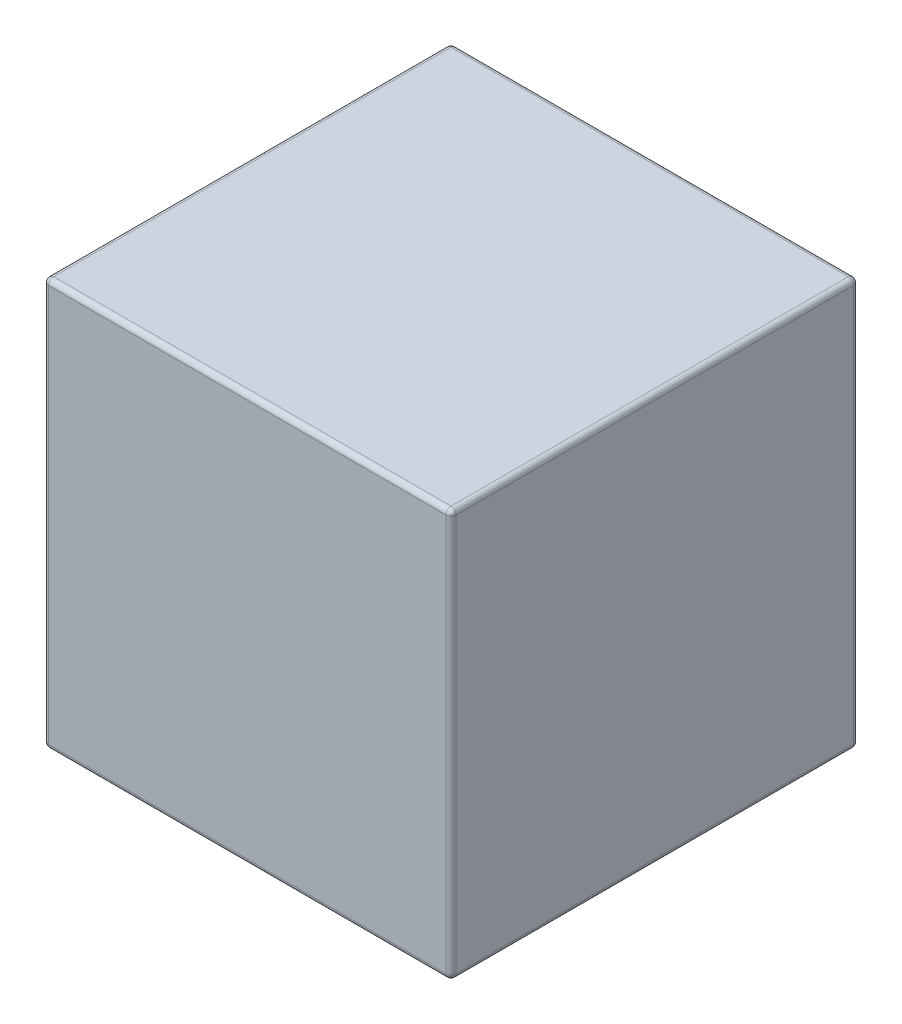
ISO-10303-21;
HEADER;
FILE_DESCRIPTION(('STEP AP214'),'2;1');
FILE_NAME('part.step','',(''),(''),'','','');
FILE_SCHEMA(('AUTOMOTIVE_DESIGN { 1 0 10303 214 1 1 1 1 }'));
ENDSEC;
DATA;
#1=APPLICATION_CONTEXT('core data for automotive mechanical design processes');
#2=APPLICATION_PROTOCOL_DEFINITION('international standard','automotive_design',2000,#1);
#3=PRODUCT_CONTEXT('',#1,'mechanical');
#4=PRODUCT('Part','Part','',(#3));
#5=PRODUCT_RELATED_PRODUCT_CATEGORY('part','',(#4));
#6=PRODUCT_DEFINITION_FORMATION('','',#4);
#7=PRODUCT_DEFINITION_CONTEXT('part definition',#1,'design');
#8=PRODUCT_DEFINITION('design','',#6,#7);
#9=PRODUCT_DEFINITION_SHAPE('','',#8);
#10=(LENGTH_UNIT() NAMED_UNIT(*) SI_UNIT(.MILLI.,.METRE.));
#11=(NAMED_UNIT(*) PLANE_ANGLE_UNIT() SI_UNIT($,.RADIAN.));
#12=(NAMED_UNIT(*) SI_UNIT($,.STERADIAN.) SOLID_ANGLE_UNIT());
#13=UNCERTAINTY_MEASURE_WITH_UNIT(LENGTH_MEASURE(1.E-05),#10,'distance_accuracy_value','');
#14=(GEOMETRIC_REPRESENTATION_CONTEXT(3) GLOBAL_UNCERTAINTY_ASSIGNED_CONTEXT((#13)) GLOBAL_UNIT_ASSIGNED_CONTEXT((#10,
#11,#12)) REPRESENTATION_CONTEXT('',''));
#15=CARTESIAN_POINT('',(0.,0.,0.));
#16=DIRECTION('',(0.,0.,1.));
#17=DIRECTION('',(1.,0.,0.));
#18=AXIS2_PLACEMENT_3D('',#15,#16,#17);
#19=CARTESIAN_POINT('',(25.4,50.8,25.4));
#20=DIRECTION('',(-1.,0.,0.));
#21=DIRECTION('',(0.,0.,1.));
#22=AXIS2_PLACEMENT_3D('',#19,#20,#21);
#23=PLANE('',#22);
#24=DIRECTION('',(0.,0.,-1.));
#25=VECTOR('',#24,1.);
#26=CARTESIAN_POINT('',(25.4,0.634999999999997,-25.4));
#27=LINE('',#26,#25);
#28=CARTESIAN_POINT('',(25.4,0.634999999999997,24.765));
#29=VERTEX_POINT('',#28);
#30=CARTESIAN_POINT('',(25.4,0.634999999999997,-24.765));
#31=VERTEX_POINT('',#30);
#32=EDGE_CURVE('E334',#29,#31,#27,.T.);
#33=ORIENTED_EDGE('',*,*,#32,.T.);
#34=DIRECTION('',(0.,-1.,0.));
#35=VECTOR('',#34,1.);
#36=CARTESIAN_POINT('',(25.4,50.8,-24.765));
#37=LINE('',#36,#35);
#38=CARTESIAN_POINT('',(25.4,50.165,-24.765));
#39=VERTEX_POINT('',#38);
#40=EDGE_CURVE('E254',#31,#39,#37,.F.);
#41=ORIENTED_EDGE('',*,*,#40,.T.);
#42=DIRECTION('',(0.,0.,-1.));
#43=VECTOR('',#42,1.);
#44=CARTESIAN_POINT('',(25.4,50.165,25.4));
#45=LINE('',#44,#43);
#46=CARTESIAN_POINT('',(25.4,50.165,24.765));
#47=VERTEX_POINT('',#46);
#48=EDGE_CURVE('E241',#39,#47,#45,.F.);
#49=ORIENTED_EDGE('',*,*,#48,.T.);
#50=DIRECTION('',(0.,-1.,0.));
#51=VECTOR('',#50,1.);
#52=CARTESIAN_POINT('',(25.4,50.8,24.765));
#53=LINE('',#52,#51);
#54=EDGE_CURVE('E329',#47,#29,#53,.T.);
#55=ORIENTED_EDGE('',*,*,#54,.T.);
#56=EDGE_LOOP('',(#33,#41,#49,#55));
#57=FACE_BOUND('',#56,.T.);
#58=ADVANCED_FACE('F43',(#57),#23,.F.);
#59=CARTESIAN_POINT('',(-25.4,50.8,-25.4));
#60=DIRECTION('',(0.,0.,1.));
#61=DIRECTION('',(1.,0.,0.));
#62=AXIS2_PLACEMENT_3D('',#59,#60,#61);
#63=PLANE('',#62);
#64=DIRECTION('',(-1.,0.,0.));
#65=VECTOR('',#64,1.);
#66=CARTESIAN_POINT('',(-25.4,0.634999999999997,-25.4));
#67=LINE('',#66,#65);
#68=CARTESIAN_POINT('',(24.765,0.634999999999997,-25.4));
#69=VERTEX_POINT('',#68);
#70=CARTESIAN_POINT('',(-24.765,0.634999999999997,-25.4));
#71=VERTEX_POINT('',#70);
#72=EDGE_CURVE('E307',#69,#71,#67,.T.);
#73=ORIENTED_EDGE('',*,*,#72,.T.);
#74=DIRECTION('',(0.,-1.,0.));
#75=VECTOR('',#74,1.);
#76=CARTESIAN_POINT('',(-24.765,50.8,-25.4));
#77=LINE('',#76,#75);
#78=CARTESIAN_POINT('',(-24.765,50.165,-25.4));
#79=VERTEX_POINT('',#78);
#80=EDGE_CURVE('E304',#71,#79,#77,.F.);
#81=ORIENTED_EDGE('',*,*,#80,.T.);
#82=DIRECTION('',(-1.,0.,0.));
#83=VECTOR('',#82,1.);
#84=CARTESIAN_POINT('',(-25.4,50.165,-25.4));
#85=LINE('',#84,#83);
#86=CARTESIAN_POINT('',(24.765,50.165,-25.4));
#87=VERTEX_POINT('',#86);
#88=EDGE_CURVE('E295',#79,#87,#85,.F.);
#89=ORIENTED_EDGE('',*,*,#88,.T.);
#90=DIRECTION('',(0.,-1.,0.));
#91=VECTOR('',#90,1.);
#92=CARTESIAN_POINT('',(24.765,50.8,-25.4));
#93=LINE('',#92,#91);
#94=EDGE_CURVE('E301',#87,#69,#93,.T.);
#95=ORIENTED_EDGE('',*,*,#94,.T.);
#96=EDGE_LOOP('',(#73,#81,#89,#95));
#97=FACE_BOUND('',#96,.T.);
#98=ADVANCED_FACE('F305',(#97),#63,.F.);
#99=CARTESIAN_POINT('',(-25.4,50.8,25.4));
#100=DIRECTION('',(1.,0.,0.));
#101=DIRECTION('',(0.,0.,-1.));
#102=AXIS2_PLACEMENT_3D('',#99,#100,#101);
#103=PLANE('',#102);
#104=DIRECTION('',(0.,0.,1.));
#105=VECTOR('',#104,1.);
#106=CARTESIAN_POINT('',(-25.4,50.165,25.4));
#107=LINE('',#106,#105);
#108=CARTESIAN_POINT('',(-25.4,50.165,24.765));
#109=VERTEX_POINT('',#108);
#110=CARTESIAN_POINT('',(-25.4,50.165,-24.765));
#111=VERTEX_POINT('',#110);
#112=EDGE_CURVE('E144',#109,#111,#107,.F.);
#113=ORIENTED_EDGE('',*,*,#112,.T.);
#114=DIRECTION('',(0.,-1.,0.));
#115=VECTOR('',#114,1.);
#116=CARTESIAN_POINT('',(-25.4,50.8,-24.765));
#117=LINE('',#116,#115);
#118=CARTESIAN_POINT('',(-25.4,0.634999999999997,-24.765));
#119=VERTEX_POINT('',#118);
#120=EDGE_CURVE('E139',#111,#119,#117,.T.);
#121=ORIENTED_EDGE('',*,*,#120,.T.);
#122=DIRECTION('',(0.,0.,1.));
#123=VECTOR('',#122,1.);
#124=CARTESIAN_POINT('',(-25.4,0.634999999999997,25.4));
#125=LINE('',#124,#123);
#126=CARTESIAN_POINT('',(-25.4,0.634999999999997,24.765));
#127=VERTEX_POINT('',#126);
#128=EDGE_CURVE('E133',#119,#127,#125,.T.);
#129=ORIENTED_EDGE('',*,*,#128,.T.);
#130=DIRECTION('',(0.,-1.,0.));
#131=VECTOR('',#130,1.);
#132=CARTESIAN_POINT('',(-25.4,50.8,24.765));
#133=LINE('',#132,#131);
#134=EDGE_CURVE('E136',#127,#109,#133,.F.);
#135=ORIENTED_EDGE('',*,*,#134,.T.);
#136=EDGE_LOOP('',(#113,#121,#129,#135));
#137=FACE_BOUND('',#136,.T.);
#138=ADVANCED_FACE('F135',(#137),#103,.F.);
#139=CARTESIAN_POINT('',(-25.4,50.8,25.4));
#140=DIRECTION('',(0.,0.,-1.));
#141=DIRECTION('',(-1.,0.,0.));
#142=AXIS2_PLACEMENT_3D('',#139,#140,#141);
#143=PLANE('',#142);
#144=DIRECTION('',(1.,0.,0.));
#145=VECTOR('',#144,1.);
#146=CARTESIAN_POINT('',(-25.4,50.165,25.4));
#147=LINE('',#146,#145);
#148=CARTESIAN_POINT('',(24.765,50.165,25.4));
#149=VERTEX_POINT('',#148);
#150=CARTESIAN_POINT('',(-24.765,50.165,25.4));
#151=VERTEX_POINT('',#150);
#152=EDGE_CURVE('E53',#149,#151,#147,.F.);
#153=ORIENTED_EDGE('',*,*,#152,.T.);
#154=DIRECTION('',(0.,-1.,0.));
#155=VECTOR('',#154,1.);
#156=CARTESIAN_POINT('',(-24.765,50.8,25.4));
#157=LINE('',#156,#155);
#158=CARTESIAN_POINT('',(-24.765,0.634999999999997,25.4));
#159=VERTEX_POINT('',#158);
#160=EDGE_CURVE('E11',#151,#159,#157,.T.);
#161=ORIENTED_EDGE('',*,*,#160,.T.);
#162=DIRECTION('',(1.,0.,0.));
#163=VECTOR('',#162,1.);
#164=CARTESIAN_POINT('',(25.4,0.634999999999997,25.4));
#165=LINE('',#164,#163);
#166=CARTESIAN_POINT('',(24.765,0.634999999999997,25.4));
#167=VERTEX_POINT('',#166);
#168=EDGE_CURVE('E261',#159,#167,#165,.T.);
#169=ORIENTED_EDGE('',*,*,#168,.T.);
#170=DIRECTION('',(0.,-1.,0.));
#171=VECTOR('',#170,1.);
#172=CARTESIAN_POINT('',(24.765,50.8,25.4));
#173=LINE('',#172,#171);
#174=EDGE_CURVE('E64',#167,#149,#173,.F.);
#175=ORIENTED_EDGE('',*,*,#174,.T.);
#176=EDGE_LOOP('',(#153,#161,#169,#175));
#177=FACE_BOUND('',#176,.T.);
#178=ADVANCED_FACE('F440',(#177),#143,.F.);
#179=CARTESIAN_POINT('',(0.,50.8,0.));
#180=DIRECTION('',(0.,-1.,0.));
#181=DIRECTION('',(0.,0.,-1.));
#182=AXIS2_PLACEMENT_3D('',#179,#180,#181);
#183=PLANE('',#182);
#184=DIRECTION('',(-1.,0.,0.));
#185=VECTOR('',#184,1.);
#186=CARTESIAN_POINT('',(0.,50.8,-24.765));
#187=LINE('',#186,#185);
#188=CARTESIAN_POINT('',(24.765,50.8,-24.765));
#189=VERTEX_POINT('',#188);
#190=CARTESIAN_POINT('',(-24.765,50.8,-24.765));
#191=VERTEX_POINT('',#190);
#192=EDGE_CURVE('E247',#189,#191,#187,.T.);
#193=ORIENTED_EDGE('',*,*,#192,.T.);
#194=DIRECTION('',(0.,0.,1.));
#195=VECTOR('',#194,1.);
#196=CARTESIAN_POINT('',(-24.765,50.8,0.));
#197=LINE('',#196,#195);
#198=CARTESIAN_POINT('',(-24.765,50.8,24.765));
#199=VERTEX_POINT('',#198);
#200=EDGE_CURVE('E252',#191,#199,#197,.T.);
#201=ORIENTED_EDGE('',*,*,#200,.T.);
#202=DIRECTION('',(1.,0.,0.));
#203=VECTOR('',#202,1.);
#204=CARTESIAN_POINT('',(0.,50.8,24.765));
#205=LINE('',#204,#203);
#206=CARTESIAN_POINT('',(24.765,50.8,24.765));
#207=VERTEX_POINT('',#206);
#208=EDGE_CURVE('E248',#199,#207,#205,.T.);
#209=ORIENTED_EDGE('',*,*,#208,.T.);
#210=DIRECTION('',(0.,0.,-1.));
#211=VECTOR('',#210,1.);
#212=CARTESIAN_POINT('',(24.765,50.8,0.));
#213=LINE('',#212,#211);
#214=EDGE_CURVE('E243',#207,#189,#213,.T.);
#215=ORIENTED_EDGE('',*,*,#214,.T.);
#216=EDGE_LOOP('',(#193,#201,#209,#215));
#217=FACE_BOUND('',#216,.T.);
#218=ADVANCED_FACE('F364',(#217),#183,.F.);
#219=CARTESIAN_POINT('',(0.,0.,0.));
#220=DIRECTION('',(0.,-1.,0.));
#221=DIRECTION('',(0.,0.,-1.));
#222=AXIS2_PLACEMENT_3D('',#219,#220,#221);
#223=PLANE('',#222);
#224=DIRECTION('',(0.,0.,1.));
#225=VECTOR('',#224,1.);
#226=CARTESIAN_POINT('',(-24.765,0.,-25.4));
#227=LINE('',#226,#225);
#228=CARTESIAN_POINT('',(-24.765,0.,24.765));
#229=VERTEX_POINT('',#228);
#230=CARTESIAN_POINT('',(-24.765,0.,-24.765));
#231=VERTEX_POINT('',#230);
#232=EDGE_CURVE('E167',#229,#231,#227,.F.);
#233=ORIENTED_EDGE('',*,*,#232,.T.);
#234=DIRECTION('',(-1.,0.,0.));
#235=VECTOR('',#234,1.);
#236=CARTESIAN_POINT('',(25.4,0.,-24.765));
#237=LINE('',#236,#235);
#238=CARTESIAN_POINT('',(24.765,0.,-24.765));
#239=VERTEX_POINT('',#238);
#240=EDGE_CURVE('E325',#231,#239,#237,.F.);
#241=ORIENTED_EDGE('',*,*,#240,.T.);
#242=DIRECTION('',(0.,0.,-1.));
#243=VECTOR('',#242,1.);
#244=CARTESIAN_POINT('',(24.765,0.,25.4));
#245=LINE('',#244,#243);
#246=CARTESIAN_POINT('',(24.765,0.,24.765));
#247=VERTEX_POINT('',#246);
#248=EDGE_CURVE('E316',#239,#247,#245,.F.);
#249=ORIENTED_EDGE('',*,*,#248,.T.);
#250=DIRECTION('',(1.,0.,0.));
#251=VECTOR('',#250,1.);
#252=CARTESIAN_POINT('',(-25.4,0.,24.765));
#253=LINE('',#252,#251);
#254=EDGE_CURVE('E312',#247,#229,#253,.F.);
#255=ORIENTED_EDGE('',*,*,#254,.T.);
#256=EDGE_LOOP('',(#233,#241,#249,#255));
#257=FACE_BOUND('',#256,.T.);
#258=ADVANCED_FACE('F431',(#257),#223,.T.);
#259=CARTESIAN_POINT('',(24.765,50.8,24.765));
#260=DIRECTION('',(0.,-1.,0.));
#261=DIRECTION('',(0.,0.,-1.));
#262=AXIS2_PLACEMENT_3D('',#259,#260,#261);
#263=CYLINDRICAL_SURFACE('',#262,0.635);
#264=CARTESIAN_POINT('',(24.765,50.165,24.765));
#265=DIRECTION('',(0.,1.,0.));
#266=DIRECTION('',(0.,0.,1.));
#267=AXIS2_PLACEMENT_3D('',#264,#265,#266);
#268=CIRCLE('',#267,0.635);
#269=EDGE_CURVE('E47',#149,#47,#268,.T.);
#270=ORIENTED_EDGE('',*,*,#269,.F.);
#271=ORIENTED_EDGE('',*,*,#174,.F.);
#272=CARTESIAN_POINT('',(24.765,0.634999999999997,24.765));
#273=DIRECTION('',(0.,-1.,0.));
#274=DIRECTION('',(0.,0.,-1.));
#275=AXIS2_PLACEMENT_3D('',#272,#273,#274);
#276=CIRCLE('',#275,0.635);
#277=EDGE_CURVE('E221',#29,#167,#276,.T.);
#278=ORIENTED_EDGE('',*,*,#277,.F.);
#279=ORIENTED_EDGE('',*,*,#54,.F.);
#280=EDGE_LOOP('',(#270,#271,#278,#279));
#281=FACE_BOUND('',#280,.T.);
#282=ADVANCED_FACE('F45',(#281),#263,.T.);
#283=CARTESIAN_POINT('',(24.765,50.165,24.765));
#284=DIRECTION('',(1.,0.,0.));
#285=DIRECTION('',(0.,0.,-1.));
#286=AXIS2_PLACEMENT_3D('',#283,#284,#285);
#287=SPHERICAL_SURFACE('',#286,0.635);
#288=CARTESIAN_POINT('',(24.765,50.165,24.765));
#289=DIRECTION('',(1.,0.,0.));
#290=DIRECTION('',(0.,0.,-1.));
#291=AXIS2_PLACEMENT_3D('',#288,#289,#290);
#292=CIRCLE('',#291,0.635);
#293=EDGE_CURVE('E214',#149,#207,#292,.F.);
#294=ORIENTED_EDGE('',*,*,#293,.F.);
#295=ORIENTED_EDGE('',*,*,#269,.T.);
#296=CARTESIAN_POINT('',(24.765,50.165,24.765));
#297=DIRECTION('',(0.,0.,1.));
#298=DIRECTION('',(1.,0.,0.));
#299=AXIS2_PLACEMENT_3D('',#296,#297,#298);
#300=CIRCLE('',#299,0.635);
#301=EDGE_CURVE('E218',#207,#47,#300,.F.);
#302=ORIENTED_EDGE('',*,*,#301,.F.);
#303=EDGE_LOOP('',(#294,#295,#302));
#304=FACE_BOUND('',#303,.T.);
#305=ADVANCED_FACE('F233',(#304),#287,.T.);
#306=CARTESIAN_POINT('',(24.765,0.635,24.765));
#307=DIRECTION('',(0.,0.,1.));
#308=DIRECTION('',(0.,-1.,0.));
#309=AXIS2_PLACEMENT_3D('',#306,#307,#308);
#310=SPHERICAL_SURFACE('',#309,0.635);
#311=CARTESIAN_POINT('',(24.765,0.635,24.765));
#312=DIRECTION('',(0.,0.,1.));
#313=DIRECTION('',(1.,0.,0.));
#314=AXIS2_PLACEMENT_3D('',#311,#312,#313);
#315=CIRCLE('',#314,0.635);
#316=EDGE_CURVE('E206',#29,#247,#315,.F.);
#317=ORIENTED_EDGE('',*,*,#316,.F.);
#318=ORIENTED_EDGE('',*,*,#277,.T.);
#319=CARTESIAN_POINT('',(24.765,0.634999999999997,24.765));
#320=DIRECTION('',(1.,0.,0.));
#321=DIRECTION('',(0.,0.,-1.));
#322=AXIS2_PLACEMENT_3D('',#319,#320,#321);
#323=CIRCLE('',#322,0.635);
#324=EDGE_CURVE('E210',#247,#167,#323,.F.);
#325=ORIENTED_EDGE('',*,*,#324,.F.);
#326=EDGE_LOOP('',(#317,#318,#325));
#327=FACE_BOUND('',#326,.T.);
#328=ADVANCED_FACE('F382',(#327),#310,.T.);
#329=CARTESIAN_POINT('',(24.765,50.165,0.));
#330=DIRECTION('',(0.,0.,-1.));
#331=DIRECTION('',(-1.,0.,0.));
#332=AXIS2_PLACEMENT_3D('',#329,#330,#331);
#333=CYLINDRICAL_SURFACE('',#332,0.635);
#334=ORIENTED_EDGE('',*,*,#301,.T.);
#335=ORIENTED_EDGE('',*,*,#48,.F.);
#336=CARTESIAN_POINT('',(24.765,50.165,-24.765));
#337=DIRECTION('',(0.,0.,-1.));
#338=DIRECTION('',(-1.,0.,0.));
#339=AXIS2_PLACEMENT_3D('',#336,#337,#338);
#340=CIRCLE('',#339,0.635);
#341=EDGE_CURVE('E199',#189,#39,#340,.T.);
#342=ORIENTED_EDGE('',*,*,#341,.F.);
#343=ORIENTED_EDGE('',*,*,#214,.F.);
#344=EDGE_LOOP('',(#334,#335,#342,#343));
#345=FACE_BOUND('',#344,.T.);
#346=ADVANCED_FACE('F239',(#345),#333,.T.);
#347=CARTESIAN_POINT('',(0.,50.165,24.765));
#348=DIRECTION('',(1.,0.,0.));
#349=DIRECTION('',(0.,0.,-1.));
#350=AXIS2_PLACEMENT_3D('',#347,#348,#349);
#351=CYLINDRICAL_SURFACE('',#350,0.635);
#352=ORIENTED_EDGE('',*,*,#293,.T.);
#353=ORIENTED_EDGE('',*,*,#208,.F.);
#354=CARTESIAN_POINT('',(-24.765,50.165,24.765));
#355=DIRECTION('',(-1.,0.,0.));
#356=DIRECTION('',(0.,0.,1.));
#357=AXIS2_PLACEMENT_3D('',#354,#355,#356);
#358=CIRCLE('',#357,0.635);
#359=EDGE_CURVE('E195',#151,#199,#358,.T.);
#360=ORIENTED_EDGE('',*,*,#359,.F.);
#361=ORIENTED_EDGE('',*,*,#152,.F.);
#362=EDGE_LOOP('',(#352,#353,#360,#361));
#363=FACE_BOUND('',#362,.T.);
#364=ADVANCED_FACE('F373',(#363),#351,.T.);
#365=CARTESIAN_POINT('',(-24.765,50.8,24.765));
#366=DIRECTION('',(0.,-1.,0.));
#367=DIRECTION('',(0.,0.,-1.));
#368=AXIS2_PLACEMENT_3D('',#365,#366,#367);
#369=CYLINDRICAL_SURFACE('',#368,0.635);
#370=CARTESIAN_POINT('',(-24.765,0.634999999999997,24.765));
#371=DIRECTION('',(0.,-1.,0.));
#372=DIRECTION('',(0.,0.,-1.));
#373=AXIS2_PLACEMENT_3D('',#370,#371,#372);
#374=CIRCLE('',#373,0.635);
#375=EDGE_CURVE('E150',#159,#127,#374,.T.);
#376=ORIENTED_EDGE('',*,*,#375,.F.);
#377=ORIENTED_EDGE('',*,*,#160,.F.);
#378=CARTESIAN_POINT('',(-24.765,50.165,24.765));
#379=DIRECTION('',(0.,1.,0.));
#380=DIRECTION('',(0.,0.,1.));
#381=AXIS2_PLACEMENT_3D('',#378,#379,#380);
#382=CIRCLE('',#381,0.635);
#383=EDGE_CURVE('E153',#109,#151,#382,.T.);
#384=ORIENTED_EDGE('',*,*,#383,.F.);
#385=ORIENTED_EDGE('',*,*,#134,.F.);
#386=EDGE_LOOP('',(#376,#377,#384,#385));
#387=FACE_BOUND('',#386,.T.);
#388=ADVANCED_FACE('F149',(#387),#369,.T.);
#389=CARTESIAN_POINT('',(-25.4,0.634999999999997,24.765));
#390=DIRECTION('',(-1.,0.,0.));
#391=DIRECTION('',(0.,0.,1.));
#392=AXIS2_PLACEMENT_3D('',#389,#390,#391);
#393=CYLINDRICAL_SURFACE('',#392,0.635);
#394=ORIENTED_EDGE('',*,*,#324,.T.);
#395=ORIENTED_EDGE('',*,*,#168,.F.);
#396=CARTESIAN_POINT('',(-24.765,0.635,24.765));
#397=DIRECTION('',(-1.,0.,0.));
#398=DIRECTION('',(0.,0.,1.));
#399=AXIS2_PLACEMENT_3D('',#396,#397,#398);
#400=CIRCLE('',#399,0.635);
#401=EDGE_CURVE('E163',#229,#159,#400,.T.);
#402=ORIENTED_EDGE('',*,*,#401,.F.);
#403=ORIENTED_EDGE('',*,*,#254,.F.);
#404=EDGE_LOOP('',(#394,#395,#402,#403));
#405=FACE_BOUND('',#404,.T.);
#406=ADVANCED_FACE('F380',(#405),#393,.T.);
#407=CARTESIAN_POINT('',(24.765,0.634999999999997,25.4));
#408=DIRECTION('',(0.,0.,1.));
#409=DIRECTION('',(1.,0.,0.));
#410=AXIS2_PLACEMENT_3D('',#407,#408,#409);
#411=CYLINDRICAL_SURFACE('',#410,0.635);
#412=ORIENTED_EDGE('',*,*,#316,.T.);
#413=ORIENTED_EDGE('',*,*,#248,.F.);
#414=CARTESIAN_POINT('',(24.765,0.634999999999997,-24.765));
#415=DIRECTION('',(0.,0.,-1.));
#416=DIRECTION('',(-1.,0.,0.));
#417=AXIS2_PLACEMENT_3D('',#414,#415,#416);
#418=CIRCLE('',#417,0.635);
#419=EDGE_CURVE('E187',#31,#239,#418,.T.);
#420=ORIENTED_EDGE('',*,*,#419,.F.);
#421=ORIENTED_EDGE('',*,*,#32,.F.);
#422=EDGE_LOOP('',(#412,#413,#420,#421));
#423=FACE_BOUND('',#422,.T.);
#424=ADVANCED_FACE('F348',(#423),#411,.T.);
#425=CARTESIAN_POINT('',(24.765,50.8,-24.765));
#426=DIRECTION('',(0.,-1.,0.));
#427=DIRECTION('',(0.,0.,-1.));
#428=AXIS2_PLACEMENT_3D('',#425,#426,#427);
#429=CYLINDRICAL_SURFACE('',#428,0.635);
#430=CARTESIAN_POINT('',(24.765,50.165,-24.765));
#431=DIRECTION('',(0.,1.,0.));
#432=DIRECTION('',(0.,0.,1.));
#433=AXIS2_PLACEMENT_3D('',#430,#431,#432);
#434=CIRCLE('',#433,0.635);
#435=EDGE_CURVE('E202',#39,#87,#434,.T.);
#436=ORIENTED_EDGE('',*,*,#435,.F.);
#437=ORIENTED_EDGE('',*,*,#40,.F.);
#438=CARTESIAN_POINT('',(24.765,0.634999999999997,-24.765));
#439=DIRECTION('',(0.,-1.,0.));
#440=DIRECTION('',(0.,0.,-1.));
#441=AXIS2_PLACEMENT_3D('',#438,#439,#440);
#442=CIRCLE('',#441,0.635);
#443=EDGE_CURVE('E183',#69,#31,#442,.T.);
#444=ORIENTED_EDGE('',*,*,#443,.F.);
#445=ORIENTED_EDGE('',*,*,#94,.F.);
#446=EDGE_LOOP('',(#436,#437,#444,#445));
#447=FACE_BOUND('',#446,.T.);
#448=ADVANCED_FACE('F344',(#447),#429,.T.);
#449=CARTESIAN_POINT('',(24.765,50.165,-24.765));
#450=DIRECTION('',(1.,0.,0.));
#451=DIRECTION('',(0.,0.,-1.));
#452=AXIS2_PLACEMENT_3D('',#449,#450,#451);
#453=SPHERICAL_SURFACE('',#452,0.635);
#454=ORIENTED_EDGE('',*,*,#341,.T.);
#455=ORIENTED_EDGE('',*,*,#435,.T.);
#456=CARTESIAN_POINT('',(24.765,50.165,-24.765));
#457=DIRECTION('',(1.,0.,0.));
#458=DIRECTION('',(0.,1.,0.));
#459=AXIS2_PLACEMENT_3D('',#456,#457,#458);
#460=CIRCLE('',#459,0.635);
#461=EDGE_CURVE('E174',#189,#87,#460,.F.);
#462=ORIENTED_EDGE('',*,*,#461,.F.);
#463=EDGE_LOOP('',(#454,#455,#462));
#464=FACE_BOUND('',#463,.T.);
#465=ADVANCED_FACE('F362',(#464),#453,.T.);
#466=CARTESIAN_POINT('',(-24.765,50.165,24.765));
#467=DIRECTION('',(0.,0.,1.));
#468=DIRECTION('',(1.,0.,0.));
#469=AXIS2_PLACEMENT_3D('',#466,#467,#468);
#470=SPHERICAL_SURFACE('',#469,0.635);
#471=ORIENTED_EDGE('',*,*,#383,.T.);
#472=ORIENTED_EDGE('',*,*,#359,.T.);
#473=CARTESIAN_POINT('',(-24.765,50.165,24.765));
#474=DIRECTION('',(0.,0.,1.));
#475=DIRECTION('',(1.,0.,0.));
#476=AXIS2_PLACEMENT_3D('',#473,#474,#475);
#477=CIRCLE('',#476,0.635);
#478=EDGE_CURVE('E169',#109,#199,#477,.F.);
#479=ORIENTED_EDGE('',*,*,#478,.F.);
#480=EDGE_LOOP('',(#471,#472,#479));
#481=FACE_BOUND('',#480,.T.);
#482=ADVANCED_FACE('F371',(#481),#470,.T.);
#483=CARTESIAN_POINT('',(-24.765,0.635,24.765));
#484=DIRECTION('',(0.,0.,1.));
#485=DIRECTION('',(0.,-1.,0.));
#486=AXIS2_PLACEMENT_3D('',#483,#484,#485);
#487=SPHERICAL_SURFACE('',#486,0.635);
#488=ORIENTED_EDGE('',*,*,#401,.T.);
#489=ORIENTED_EDGE('',*,*,#375,.T.);
#490=CARTESIAN_POINT('',(-24.765,0.634999999999997,24.765));
#491=DIRECTION('',(0.,0.,1.));
#492=DIRECTION('',(1.,0.,0.));
#493=AXIS2_PLACEMENT_3D('',#490,#491,#492);
#494=CIRCLE('',#493,0.635);
#495=EDGE_CURVE('E160',#229,#127,#494,.F.);
#496=ORIENTED_EDGE('',*,*,#495,.F.);
#497=EDGE_LOOP('',(#488,#489,#496));
#498=FACE_BOUND('',#497,.T.);
#499=ADVANCED_FACE('F159',(#498),#487,.T.);
#500=CARTESIAN_POINT('',(24.765,0.635,-24.765));
#501=DIRECTION('',(1.,0.,0.));
#502=DIRECTION('',(0.,1.,0.));
#503=AXIS2_PLACEMENT_3D('',#500,#501,#502);
#504=SPHERICAL_SURFACE('',#503,0.635);
#505=ORIENTED_EDGE('',*,*,#443,.T.);
#506=ORIENTED_EDGE('',*,*,#419,.T.);
#507=CARTESIAN_POINT('',(24.765,0.635,-24.765));
#508=DIRECTION('',(1.,0.,0.));
#509=DIRECTION('',(0.,0.,-1.));
#510=AXIS2_PLACEMENT_3D('',#507,#508,#509);
#511=CIRCLE('',#510,0.635);
#512=EDGE_CURVE('E170',#69,#239,#511,.F.);
#513=ORIENTED_EDGE('',*,*,#512,.F.);
#514=EDGE_LOOP('',(#505,#506,#513));
#515=FACE_BOUND('',#514,.T.);
#516=ADVANCED_FACE('F350',(#515),#504,.T.);
#517=CARTESIAN_POINT('',(0.,50.165,-24.765));
#518=DIRECTION('',(-1.,0.,0.));
#519=DIRECTION('',(0.,0.,1.));
#520=AXIS2_PLACEMENT_3D('',#517,#518,#519);
#521=CYLINDRICAL_SURFACE('',#520,0.635);
#522=ORIENTED_EDGE('',*,*,#461,.T.);
#523=ORIENTED_EDGE('',*,*,#88,.F.);
#524=CARTESIAN_POINT('',(-24.765,50.165,-24.765));
#525=DIRECTION('',(-1.,0.,0.));
#526=DIRECTION('',(0.,0.,1.));
#527=AXIS2_PLACEMENT_3D('',#524,#525,#526);
#528=CIRCLE('',#527,0.635);
#529=EDGE_CURVE('E176',#191,#79,#528,.T.);
#530=ORIENTED_EDGE('',*,*,#529,.F.);
#531=ORIENTED_EDGE('',*,*,#192,.F.);
#532=EDGE_LOOP('',(#522,#523,#530,#531));
#533=FACE_BOUND('',#532,.T.);
#534=ADVANCED_FACE('F297',(#533),#521,.T.);
#535=CARTESIAN_POINT('',(-24.765,50.165,0.));
#536=DIRECTION('',(0.,0.,1.));
#537=DIRECTION('',(1.,0.,0.));
#538=AXIS2_PLACEMENT_3D('',#535,#536,#537);
#539=CYLINDRICAL_SURFACE('',#538,0.635);
#540=ORIENTED_EDGE('',*,*,#478,.T.);
#541=ORIENTED_EDGE('',*,*,#200,.F.);
#542=CARTESIAN_POINT('',(-24.765,50.165,-24.765));
#543=DIRECTION('',(0.,0.,-1.));
#544=DIRECTION('',(0.,1.,0.));
#545=AXIS2_PLACEMENT_3D('',#542,#543,#544);
#546=CIRCLE('',#545,0.635);
#547=EDGE_CURVE('E282',#111,#191,#546,.T.);
#548=ORIENTED_EDGE('',*,*,#547,.F.);
#549=ORIENTED_EDGE('',*,*,#112,.F.);
#550=EDGE_LOOP('',(#540,#541,#548,#549));
#551=FACE_BOUND('',#550,.T.);
#552=ADVANCED_FACE('F366',(#551),#539,.T.);
#553=CARTESIAN_POINT('',(-24.765,0.634999999999997,25.4));
#554=DIRECTION('',(0.,0.,-1.));
#555=DIRECTION('',(-1.,0.,0.));
#556=AXIS2_PLACEMENT_3D('',#553,#554,#555);
#557=CYLINDRICAL_SURFACE('',#556,0.635);
#558=ORIENTED_EDGE('',*,*,#495,.T.);
#559=ORIENTED_EDGE('',*,*,#128,.F.);
#560=CARTESIAN_POINT('',(-24.765,0.635,-24.765));
#561=DIRECTION('',(0.,0.,-1.));
#562=DIRECTION('',(-1.,0.,0.));
#563=AXIS2_PLACEMENT_3D('',#560,#561,#562);
#564=CIRCLE('',#563,0.635);
#565=EDGE_CURVE('E278',#231,#119,#564,.T.);
#566=ORIENTED_EDGE('',*,*,#565,.F.);
#567=ORIENTED_EDGE('',*,*,#232,.F.);
#568=EDGE_LOOP('',(#558,#559,#566,#567));
#569=FACE_BOUND('',#568,.T.);
#570=ADVANCED_FACE('F166',(#569),#557,.T.);
#571=CARTESIAN_POINT('',(-25.4,0.634999999999997,-24.765));
#572=DIRECTION('',(1.,0.,0.));
#573=DIRECTION('',(0.,0.,-1.));
#574=AXIS2_PLACEMENT_3D('',#571,#572,#573);
#575=CYLINDRICAL_SURFACE('',#574,0.635);
#576=ORIENTED_EDGE('',*,*,#512,.T.);
#577=ORIENTED_EDGE('',*,*,#240,.F.);
#578=CARTESIAN_POINT('',(-24.765,0.634999999999997,-24.765));
#579=DIRECTION('',(-1.,0.,0.));
#580=DIRECTION('',(0.,0.,1.));
#581=AXIS2_PLACEMENT_3D('',#578,#579,#580);
#582=CIRCLE('',#581,0.635);
#583=EDGE_CURVE('E274',#71,#231,#582,.T.);
#584=ORIENTED_EDGE('',*,*,#583,.F.);
#585=ORIENTED_EDGE('',*,*,#72,.F.);
#586=EDGE_LOOP('',(#576,#577,#584,#585));
#587=FACE_BOUND('',#586,.T.);
#588=ADVANCED_FACE('F353',(#587),#575,.T.);
#589=CARTESIAN_POINT('',(-24.765,50.165,-24.765));
#590=DIRECTION('',(0.,1.,0.));
#591=DIRECTION('',(0.,0.,1.));
#592=AXIS2_PLACEMENT_3D('',#589,#590,#591);
#593=SPHERICAL_SURFACE('',#592,0.635);
#594=ORIENTED_EDGE('',*,*,#547,.T.);
#595=ORIENTED_EDGE('',*,*,#529,.T.);
#596=CARTESIAN_POINT('',(-24.765,50.165,-24.765));
#597=DIRECTION('',(0.,1.,0.));
#598=DIRECTION('',(0.,0.,1.));
#599=AXIS2_PLACEMENT_3D('',#596,#597,#598);
#600=CIRCLE('',#599,0.635);
#601=EDGE_CURVE('E271',#111,#79,#600,.F.);
#602=ORIENTED_EDGE('',*,*,#601,.F.);
#603=EDGE_LOOP('',(#594,#595,#602));
#604=FACE_BOUND('',#603,.T.);
#605=ADVANCED_FACE('F291',(#604),#593,.T.);
#606=CARTESIAN_POINT('',(-24.765,0.635,-24.765));
#607=DIRECTION('',(0.,-1.,0.));
#608=DIRECTION('',(0.,0.,-1.));
#609=AXIS2_PLACEMENT_3D('',#606,#607,#608);
#610=SPHERICAL_SURFACE('',#609,0.635);
#611=ORIENTED_EDGE('',*,*,#583,.T.);
#612=ORIENTED_EDGE('',*,*,#565,.T.);
#613=CARTESIAN_POINT('',(-24.765,0.634999999999997,-24.765));
#614=DIRECTION('',(0.,-1.,0.));
#615=DIRECTION('',(0.,0.,-1.));
#616=AXIS2_PLACEMENT_3D('',#613,#614,#615);
#617=CIRCLE('',#616,0.635);
#618=EDGE_CURVE('E268',#71,#119,#617,.F.);
#619=ORIENTED_EDGE('',*,*,#618,.F.);
#620=EDGE_LOOP('',(#611,#612,#619));
#621=FACE_BOUND('',#620,.T.);
#622=ADVANCED_FACE('F355',(#621),#610,.T.);
#623=CARTESIAN_POINT('',(-24.765,50.8,-24.765));
#624=DIRECTION('',(0.,-1.,0.));
#625=DIRECTION('',(0.,0.,-1.));
#626=AXIS2_PLACEMENT_3D('',#623,#624,#625);
#627=CYLINDRICAL_SURFACE('',#626,0.635);
#628=ORIENTED_EDGE('',*,*,#601,.T.);
#629=ORIENTED_EDGE('',*,*,#80,.F.);
#630=ORIENTED_EDGE('',*,*,#618,.T.);
#631=ORIENTED_EDGE('',*,*,#120,.F.);
#632=EDGE_LOOP('',(#628,#629,#630,#631));
#633=FACE_BOUND('',#632,.T.);
#634=ADVANCED_FACE('F356',(#633),#627,.T.);
#635=CLOSED_SHELL('',(#58,#98,#138,#178,#218,#258,#282,#305,#328,#346,#364,#388,#406,#424,#448,
#465,#482,#499,#516,#534,#552,#570,#588,#605,#622,#634));
#636=MANIFOLD_SOLID_BREP('B2',#635);
#637=ADVANCED_BREP_SHAPE_REPRESENTATION('',(#18,#636),#14);
#638=SHAPE_DEFINITION_REPRESENTATION(#9,#637);
ENDSEC;
END-ISO-10303-21;
